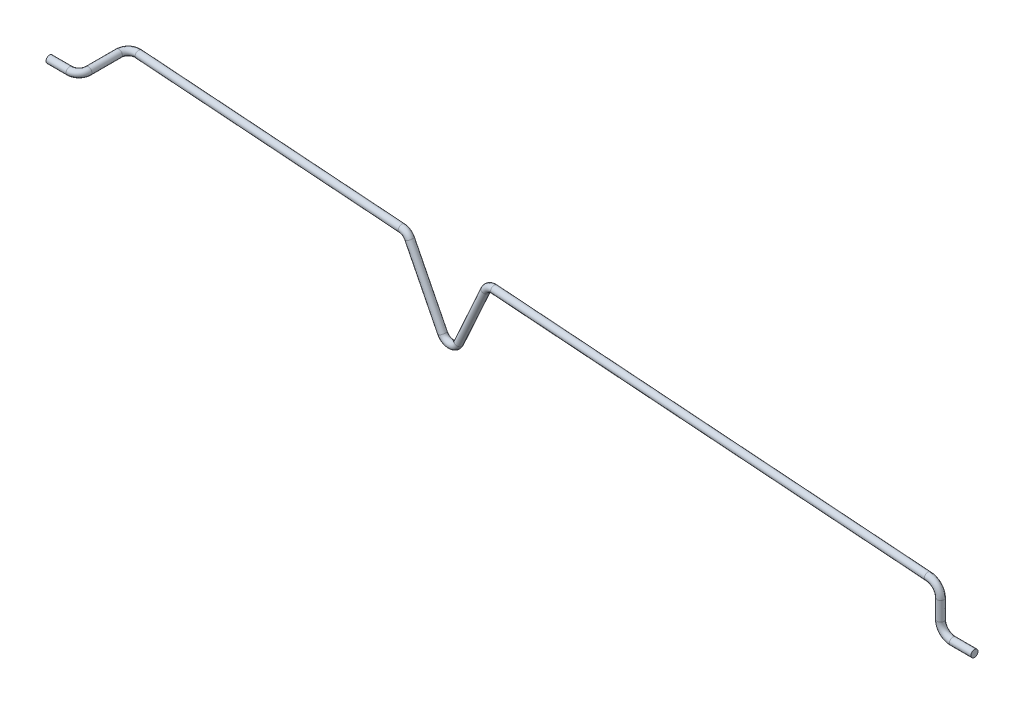
ISO-10303-21;
HEADER;
FILE_DESCRIPTION(('STEP AP214'),'2;1');
FILE_NAME('part.step','',(''),(''),'','','');
FILE_SCHEMA(('AUTOMOTIVE_DESIGN { 1 0 10303 214 1 1 1 1 }'));
ENDSEC;
DATA;
#1=APPLICATION_CONTEXT('core data for automotive mechanical design processes');
#2=APPLICATION_PROTOCOL_DEFINITION('international standard','automotive_design',2000,#1);
#3=PRODUCT_CONTEXT('',#1,'mechanical');
#4=PRODUCT('Part','Part','',(#3));
#5=PRODUCT_RELATED_PRODUCT_CATEGORY('part','',(#4));
#6=PRODUCT_DEFINITION_FORMATION('','',#4);
#7=PRODUCT_DEFINITION_CONTEXT('part definition',#1,'design');
#8=PRODUCT_DEFINITION('design','',#6,#7);
#9=PRODUCT_DEFINITION_SHAPE('','',#8);
#10=(LENGTH_UNIT() NAMED_UNIT(*) SI_UNIT(.MILLI.,.METRE.));
#11=(NAMED_UNIT(*) PLANE_ANGLE_UNIT() SI_UNIT($,.RADIAN.));
#12=(NAMED_UNIT(*) SI_UNIT($,.STERADIAN.) SOLID_ANGLE_UNIT());
#13=UNCERTAINTY_MEASURE_WITH_UNIT(LENGTH_MEASURE(1.E-05),#10,'distance_accuracy_value','');
#14=(GEOMETRIC_REPRESENTATION_CONTEXT(3) GLOBAL_UNCERTAINTY_ASSIGNED_CONTEXT((#13)) GLOBAL_UNIT_ASSIGNED_CONTEXT((#10,
#11,#12)) REPRESENTATION_CONTEXT('',''));
#15=CARTESIAN_POINT('',(0.,0.,0.));
#16=DIRECTION('',(0.,0.,1.));
#17=DIRECTION('',(1.,0.,0.));
#18=AXIS2_PLACEMENT_3D('',#15,#16,#17);
#19=CARTESIAN_POINT('',(-64.2188495074616,22.8960481279428,15.8483363673903));
#20=DIRECTION('',(1.,0.,0.));
#21=DIRECTION('',(0.,0.,-1.));
#22=AXIS2_PLACEMENT_3D('',#19,#20,#21);
#23=PLANE('',#22);
#24=CARTESIAN_POINT('',(-64.2188495074616,22.8960481279428,15.8483363673903));
#25=DIRECTION('',(1.,0.,0.));
#26=DIRECTION('',(0.,0.,-1.));
#27=AXIS2_PLACEMENT_3D('',#24,#25,#26);
#28=CIRCLE('',#27,0.375000000000001);
#29=CARTESIAN_POINT('',(-64.2188495074616,22.8960481279428,15.4733363673903));
#30=VERTEX_POINT('',#29);
#31=EDGE_CURVE('E235',#30,#30,#28,.T.);
#32=ORIENTED_EDGE('',*,*,#31,.F.);
#33=EDGE_LOOP('',(#32));
#34=FACE_BOUND('',#33,.T.);
#35=ADVANCED_FACE('F32',(#34),#23,.F.);
#36=CARTESIAN_POINT('',(31.4149506491111,14.4905385881416,13.));
#37=DIRECTION('',(1.,0.,0.));
#38=DIRECTION('',(0.,0.00337516126734805,-0.999994304126988));
#39=AXIS2_PLACEMENT_3D('',#36,#37,#38);
#40=PLANE('',#39);
#41=CARTESIAN_POINT('',(31.4149506491111,14.4905385881416,13.));
#42=DIRECTION('',(1.,0.,0.));
#43=DIRECTION('',(0.,0.00337516126734805,-0.999994304126988));
#44=AXIS2_PLACEMENT_3D('',#41,#42,#43);
#45=CIRCLE('',#44,0.375000000000001);
#46=CARTESIAN_POINT('',(31.4149506491111,14.4918042736168,12.6250021359524));
#47=VERTEX_POINT('',#46);
#48=EDGE_CURVE('E10',#47,#47,#45,.T.);
#49=ORIENTED_EDGE('',*,*,#48,.T.);
#50=EDGE_LOOP('',(#49));
#51=FACE_BOUND('',#50,.T.);
#52=ADVANCED_FACE('F129',(#51),#40,.T.);
#53=CARTESIAN_POINT('',(-59.66685028374,22.8959019788377,10.285494709423));
#54=CARTESIAN_POINT('',(-59.7419632939482,22.8959081179173,10.2735671038188));
#55=CARTESIAN_POINT('',(-59.7861856713361,22.8959117322668,10.2665215878197));
#56=CARTESIAN_POINT('',(-59.9491788533054,22.895925053902,10.2406873776312));
#57=CARTESIAN_POINT('',(-60.0620729197661,22.8959342808739,10.2336669901577));
#58=CARTESIAN_POINT('',(-60.2598447638031,22.895950445012,10.2453293695001));
#59=CARTESIAN_POINT('',(-60.3580820421677,22.8959584740666,10.2618879061166));
#60=CARTESIAN_POINT('',(-60.6439786449227,22.8959818407504,10.3425501113274));
#61=CARTESIAN_POINT('',(-60.8221902372007,22.8959964062049,10.4377969517152));
#62=CARTESIAN_POINT('',(-61.2740156605615,22.8960333344571,10.8235356976156));
#63=CARTESIAN_POINT('',(-61.45501726574,22.8960481279428,11.2145956624061));
#64=CARTESIAN_POINT('',(-61.45501726574,22.8960481279428,11.6121137336988));
#65=CARTESIAN_POINT('',(-59.6668317190504,23.0922515181698,10.2854788601156));
#66=CARTESIAN_POINT('',(-59.7419451260393,23.0922576572818,10.2735511915044));
#67=CARTESIAN_POINT('',(-59.7861665783051,23.0922612715557,10.2665058221397));
#68=CARTESIAN_POINT('',(-59.9491608616475,23.0922745932809,10.2406714376226));
#69=CARTESIAN_POINT('',(-60.0620566624428,23.0922838203945,10.2336509020387));
#70=CARTESIAN_POINT('',(-60.2598308147132,23.0922999847213,10.245313417495));
#71=CARTESIAN_POINT('',(-60.3580692396241,23.0923080138696,10.2618721473694));
#72=CARTESIAN_POINT('',(-60.643969179134,23.0923313808262,10.3425352940042));
#73=CARTESIAN_POINT('',(-60.822182851354,23.0923459464508,10.4377832460359));
#74=CARTESIAN_POINT('',(-61.2740135480564,23.0923828751335,10.8235264939696));
#75=CARTESIAN_POINT('',(-61.45501726574,23.0923976687921,11.2145910228949));
#76=CARTESIAN_POINT('',(-61.45501726574,23.0923976687921,11.6121137336988));
#77=CARTESIAN_POINT('',(-59.6948326599645,23.2709188671956,10.4619041950578));
#78=CARTESIAN_POINT('',(-59.765529332498,23.2709246453224,10.4506778838612));
#79=CARTESIAN_POINT('',(-59.8200487142283,23.270929101259,10.4420002644178));
#80=CARTESIAN_POINT('',(-59.9707831417774,23.2709414209707,10.4181064055597));
#81=CARTESIAN_POINT('',(-60.0643733360512,23.2709490702133,10.4127345499684));
#82=CARTESIAN_POINT('',(-60.2364535661927,23.270963134544,10.4228819242368));
#83=CARTESIAN_POINT('',(-60.3219292998683,23.2709701205817,10.4372894189219));
#84=CARTESIAN_POINT('',(-60.5706864140982,23.2709904518091,10.5074731748749));
#85=CARTESIAN_POINT('',(-60.7257473731661,23.2710031251335,10.5903469443642));
#86=CARTESIAN_POINT('',(-61.1188782721293,23.2710352562097,10.9259761765848));
#87=CARTESIAN_POINT('',(-61.2763668065893,23.2710481279428,11.2662353730734));
#88=CARTESIAN_POINT('',(-61.2763668065893,23.2710481279428,11.6121137336988));
#89=CARTESIAN_POINT('',(-59.756419834252,23.2709559965747,10.8497438363423));
#90=CARTESIAN_POINT('',(-59.817407103612,23.2709609811399,10.8400593343661));
#91=CARTESIAN_POINT('',(-59.8945646470963,23.2709672873216,10.8277935041633));
#92=CARTESIAN_POINT('',(-60.0183479676792,23.2709774042859,10.8081655449608));
#93=CARTESIAN_POINT('',(-60.0694982283107,23.2709815848601,10.8064180183642));
#94=CARTESIAN_POINT('',(-60.1850949520155,23.2709910327237,10.8132346248894));
#95=CARTESIAN_POINT('',(-60.2425141846665,23.2709957256688,10.8229130125867));
#96=CARTESIAN_POINT('',(-60.4096194202858,23.2710093833869,10.8700596966589));
#97=CARTESIAN_POINT('',(-60.5137832677416,23.2710178968272,10.92573103221));
#98=CARTESIAN_POINT('',(-60.7778731278621,23.2710394812195,11.1511935364873));
#99=CARTESIAN_POINT('',(-60.8836677248906,23.2710481279428,11.379766268474));
#100=CARTESIAN_POINT('',(-60.8836677248906,23.2710481279428,11.6121137336988));
#101=CARTESIAN_POINT('',(-59.7844545576776,23.0923224300603,11.0261980125646));
#102=CARTESIAN_POINT('',(-59.8410243705521,23.0923270535814,11.017214982658));
#103=CARTESIAN_POINT('',(-59.9284815269653,23.0923342015631,11.0033166355428));
#104=CARTESIAN_POINT('',(-60.0400029875627,23.0923433163506,10.9856295192288));
#105=CARTESIAN_POINT('',(-60.0718444856738,23.0923459187954,10.9855309421438));
#106=CARTESIAN_POINT('',(-60.1617430869135,23.0923532663199,10.9908321597924));
#107=CARTESIAN_POINT('',(-60.2063975419373,23.0923569159838,10.9983589606251));
#108=CARTESIAN_POINT('',(-60.3363538803235,23.0923675374764,11.0350245408887));
#109=CARTESIAN_POINT('',(-60.4173612297189,23.0923741583076,11.0783196710169));
#110=CARTESIAN_POINT('',(-60.6227416960955,23.0923909443078,11.2536599671513));
#111=CARTESIAN_POINT('',(-60.70501726574,23.0923976687921,11.4314190612556));
#112=CARTESIAN_POINT('',(-60.70501726574,23.0923976687921,11.6121137336988));
#113=CARTESIAN_POINT('',(-59.7844916870567,22.6996233513963,11.0262297111795));
#114=CARTESIAN_POINT('',(-59.8410607063701,22.6996279748524,11.0172468072868));
#115=CARTESIAN_POINT('',(-59.9285197130273,22.6996351229853,11.0033481669027));
#116=CARTESIAN_POINT('',(-60.0400389708783,22.6996442375928,10.985661399246));
#117=CARTESIAN_POINT('',(-60.0718770003203,22.6996468397542,10.985563118382));
#118=CARTESIAN_POINT('',(-60.1617709850934,22.6996541869013,10.9908640638026));
#119=CARTESIAN_POINT('',(-60.2064231470246,22.6996578363779,10.9983904781197));
#120=CARTESIAN_POINT('',(-60.336372811901,22.6996684573247,11.0350541755346));
#121=CARTESIAN_POINT('',(-60.4173760014123,22.6996750778159,11.0783470823748));
#122=CARTESIAN_POINT('',(-60.6227459211057,22.6996918629549,11.2536783744445));
#123=CARTESIAN_POINT('',(-60.70501726574,22.6996985870934,11.4314283402772));
#124=CARTESIAN_POINT('',(-60.70501726574,22.6996985870934,11.6121137336988));
#125=CARTESIAN_POINT('',(-59.7564907461426,22.5209560023704,10.8498043762373));
#126=CARTESIAN_POINT('',(-59.8174764999117,22.5209609868118,10.84012011493));
#127=CARTESIAN_POINT('',(-59.8946375771036,22.5209672932821,10.8278537246248));
#128=CARTESIAN_POINT('',(-60.018416690749,22.5209774099029,10.8082264313087));
#129=CARTESIAN_POINT('',(-60.0695603267119,22.5209815899356,10.8064794704524));
#130=CARTESIAN_POINT('',(-60.1851482336138,22.5209910370784,10.8132955570607));
#131=CARTESIAN_POINT('',(-60.2425630867806,22.5209957296658,10.822973206567));
#132=CARTESIAN_POINT('',(-60.4096555769362,22.5210093863418,10.8701162946643));
#133=CARTESIAN_POINT('',(-60.5138114795997,22.5210178991331,10.925783384047));
#134=CARTESIAN_POINT('',(-60.7778811970338,22.5210394818787,11.1512286918282));
#135=CARTESIAN_POINT('',(-60.8836677248906,22.5210481279428,11.3797839900994));
#136=CARTESIAN_POINT('',(-60.8836677248906,22.5210481279428,11.6121137336988));
#137=CARTESIAN_POINT('',(-59.6949035718551,22.5209188729913,10.4619647349527));
#138=CARTESIAN_POINT('',(-59.7655987287977,22.5209246509943,10.4507386644251));
#139=CARTESIAN_POINT('',(-59.8201216442356,22.5209291072195,10.4420604848793));
#140=CARTESIAN_POINT('',(-59.9708518648472,22.5209414265877,10.4181672919076));
#141=CARTESIAN_POINT('',(-60.0644354344523,22.5209490752888,10.4127960020566));
#142=CARTESIAN_POINT('',(-60.2365068477911,22.5209631388987,10.4229428564081));
#143=CARTESIAN_POINT('',(-60.3219782019824,22.5209701245786,10.4373496129025));
#144=CARTESIAN_POINT('',(-60.5707225707487,22.520990454764,10.5075297728799));
#145=CARTESIAN_POINT('',(-60.7257755850231,22.5210031274395,10.5903992962007));
#146=CARTESIAN_POINT('',(-61.118886341303,22.5210352568689,10.9260113319267));
#147=CARTESIAN_POINT('',(-61.2763668065893,22.5210481279428,11.2662530946981));
#148=CARTESIAN_POINT('',(-61.2763668065893,22.5210481279428,11.6121137336988));
#149=CARTESIAN_POINT('',(-59.6668688484295,22.6995524395057,10.2855105587304));
#150=CARTESIAN_POINT('',(-59.7419814618572,22.6995585785528,10.2735830161332));
#151=CARTESIAN_POINT('',(-59.7862047643672,22.6995621929779,10.2665373534997));
#152=CARTESIAN_POINT('',(-59.9491968449632,22.6995755145231,10.2407033176398));
#153=CARTESIAN_POINT('',(-60.0620891770893,22.6995847413533,10.2336830782768));
#154=CARTESIAN_POINT('',(-60.2598587128931,22.6996009053027,10.2453453215053));
#155=CARTESIAN_POINT('',(-60.3580948447114,22.6996089342637,10.2619036648638));
#156=CARTESIAN_POINT('',(-60.6439881107115,22.6996323006746,10.3425649286506));
#157=CARTESIAN_POINT('',(-60.8221976230474,22.6996468659591,10.4378106573944));
#158=CARTESIAN_POINT('',(-61.2740177730667,22.6996837937806,10.8235449012617));
#159=CARTESIAN_POINT('',(-61.45501726574,22.6996985870934,11.2146003019172));
#160=CARTESIAN_POINT('',(-61.45501726574,22.6996985870934,11.6121137336988));
#161=CARTESIAN_POINT('',(-59.66685028374,22.8959019788377,10.285494709423));
#162=CARTESIAN_POINT('',(-59.7419632939482,22.8959081179173,10.2735671038188));
#163=CARTESIAN_POINT('',(-59.7861856713361,22.8959117322668,10.2665215878197));
#164=CARTESIAN_POINT('',(-59.9491788533054,22.895925053902,10.2406873776312));
#165=CARTESIAN_POINT('',(-60.0620729197661,22.8959342808739,10.2336669901577));
#166=CARTESIAN_POINT('',(-60.2598447638031,22.895950445012,10.2453293695001));
#167=CARTESIAN_POINT('',(-60.3580820421677,22.8959584740666,10.2618879061166));
#168=CARTESIAN_POINT('',(-60.6439786449227,22.8959818407504,10.3425501113274));
#169=CARTESIAN_POINT('',(-60.8221902372007,22.8959964062049,10.4377969517152));
#170=CARTESIAN_POINT('',(-61.2740156605615,22.8960333344571,10.8235356976156));
#171=CARTESIAN_POINT('',(-61.45501726574,22.8960481279428,11.2145956624061));
#172=CARTESIAN_POINT('',(-61.45501726574,22.8960481279428,11.6121137336988));
#173=B_SPLINE_SURFACE_WITH_KNOTS('',3,3,((#53,#54,#55,#56,#57,#58,#59,#60,#61,#62,#63,#64),(#65,
#66,#67,#68,#69,#70,#71,#72,#73,#74,#75,#76),(#77,#78,#79,#80,#81,#82,#83,#84,#85,#86,#87,#88),
(#89,#90,#91,#92,#93,#94,#95,#96,#97,#98,#99,#100),(#101,#102,#103,#104,#105,#106,#107,#108,
#109,#110,#111,#112),(#113,#114,#115,#116,#117,#118,#119,#120,#121,#122,#123,#124),(#125,#126,
#127,#128,#129,#130,#131,#132,#133,#134,#135,#136),(#137,#138,#139,#140,#141,#142,#143,#144,
#145,#146,#147,#148),(#149,#150,#151,#152,#153,#154,#155,#156,#157,#158,#159,#160),(#161,#162,
#163,#164,#165,#166,#167,#168,#169,#170,#171,#172)),.UNSPECIFIED.,.T.,.F.,.F.,(4,2,2,2,4),(4,2,
2,2,2,4),(0.,0.25,0.5,0.75,1.),(-0.0229632619529378,0.,0.0249056285781138,0.0498112571562277,
0.0996225143124553,0.199245028624911),.UNSPECIFIED.);
#174=CARTESIAN_POINT('',(-59.9231868103733,22.895953578755,10.6244881938014));
#175=DIRECTION('',(-0.995488107498007,0.0217371518266946,-0.0923630015780107));
#176=DIRECTION('',(-0.0808192973258083,0.315774535423993,0.945385997335228));
#177=AXIS2_PLACEMENT_3D('',#174,#175,#176);
#178=ELLIPSE('',#177,0.375880853129422,0.375000000000001);
#179=CARTESIAN_POINT('',(-59.9535652368014,23.0146471805267,10.9798406890164));
#180=VERTEX_POINT('',#179);
#181=EDGE_CURVE('E35',#180,#180,#178,.T.);
#182=CARTESIAN_POINT('',(-61.08001726574,22.8960481279428,11.6121137336988));
#183=DIRECTION('',(0.,0.,-1.));
#184=DIRECTION('',(-1.,0.,0.));
#185=AXIS2_PLACEMENT_3D('',#182,#183,#184);
#186=CIRCLE('',#185,0.375000000000001);
#187=CARTESIAN_POINT('',(-61.45501726574,22.8960481279428,11.6121137336988));
#188=VERTEX_POINT('',#187);
#189=EDGE_CURVE('E226',#188,#188,#186,.T.);
#190=ORIENTED_EDGE('',*,*,#181,.T.);
#191=EDGE_LOOP('',(#190));
#192=FACE_BOUND('',#191,.T.);
#193=ORIENTED_EDGE('',*,*,#189,.T.);
#194=EDGE_LOOP('',(#193));
#195=FACE_BOUND('',#194,.T.);
#196=ADVANCED_FACE('F122',(#192,#195),#173,.F.);
#197=CARTESIAN_POINT('',(-61.08001726574,22.8960481279428,11.6121137336988));
#198=DIRECTION('',(0.,0.,1.));
#199=DIRECTION('',(1.,0.,0.));
#200=AXIS2_PLACEMENT_3D('',#197,#198,#199);
#201=CYLINDRICAL_SURFACE('',#200,0.375000000000001);
#202=CARTESIAN_POINT('',(-61.08001726574,22.8960481279428,14.8483363673903));
#203=DIRECTION('',(0.,0.,-1.));
#204=DIRECTION('',(-1.,0.,0.));
#205=AXIS2_PLACEMENT_3D('',#202,#203,#204);
#206=CIRCLE('',#205,0.375000000000001);
#207=CARTESIAN_POINT('',(-60.70501726574,22.8960481279428,14.8483363673903));
#208=VERTEX_POINT('',#207);
#209=EDGE_CURVE('E228',#208,#208,#206,.T.);
#210=ORIENTED_EDGE('',*,*,#209,.T.);
#211=EDGE_LOOP('',(#210));
#212=FACE_BOUND('',#211,.T.);
#213=ORIENTED_EDGE('',*,*,#189,.F.);
#214=EDGE_LOOP('',(#213));
#215=FACE_BOUND('',#214,.T.);
#216=ADVANCED_FACE('F111',(#212,#215),#201,.T.);
#217=CARTESIAN_POINT('',(-62.08001726574,22.8960481279428,14.8483363673903));
#218=DIRECTION('',(0.,-1.,0.));
#219=DIRECTION('',(0.,0.,-1.));
#220=AXIS2_PLACEMENT_3D('',#217,#218,#219);
#221=TOROIDAL_SURFACE('',#220,1.00000000000001,0.375000000000001);
#222=CARTESIAN_POINT('',(-62.08001726574,22.8960481279428,15.8483363673903));
#223=DIRECTION('',(1.,0.,0.));
#224=DIRECTION('',(0.,0.,-1.));
#225=AXIS2_PLACEMENT_3D('',#222,#223,#224);
#226=CIRCLE('',#225,0.375000000000001);
#227=CARTESIAN_POINT('',(-62.08001726574,22.8960481279428,16.2233363673903));
#228=VERTEX_POINT('',#227);
#229=EDGE_CURVE('E232',#228,#228,#226,.T.);
#230=CARTESIAN_POINT('',(-62.08001726574,22.8960481279428,14.8483363673903));
#231=DIRECTION('',(0.,-1.,0.));
#232=DIRECTION('',(0.,0.,-1.));
#233=AXIS2_PLACEMENT_3D('',#230,#231,#232);
#234=CIRCLE('',#233,1.37500000000001);
#235=EDGE_CURVE('',#208,#228,#234,.T.);
#236=ORIENTED_EDGE('',*,*,#209,.F.);
#237=ORIENTED_EDGE('',*,*,#229,.T.);
#238=ORIENTED_EDGE('',*,*,#235,.T.);
#239=ORIENTED_EDGE('',*,*,#235,.F.);
#240=EDGE_LOOP('',(#236,#238,#237,#239));
#241=FACE_BOUND('',#240,.T.);
#242=ADVANCED_FACE('F121',(#241),#221,.T.);
#243=CARTESIAN_POINT('',(-62.08001726574,22.8960481279428,15.8483363673903));
#244=DIRECTION('',(-1.,0.,0.));
#245=DIRECTION('',(0.,0.,1.));
#246=AXIS2_PLACEMENT_3D('',#243,#244,#245);
#247=CYLINDRICAL_SURFACE('',#246,0.375000000000001);
#248=ORIENTED_EDGE('',*,*,#31,.T.);
#249=EDGE_LOOP('',(#248));
#250=FACE_BOUND('',#249,.T.);
#251=ORIENTED_EDGE('',*,*,#229,.F.);
#252=EDGE_LOOP('',(#251));
#253=FACE_BOUND('',#252,.T.);
#254=ADVANCED_FACE('F90',(#250,#253),#247,.T.);
#255=CARTESIAN_POINT('',(26.6556677747406,19.1428719036104,13.0053038780196));
#256=DIRECTION('',(-0.998684950906861,0.0432917044981977,-0.027462650159852));
#257=DIRECTION('',(-0.0433080389785005,-0.999061766739092,0.));
#258=AXIS2_PLACEMENT_3D('',#255,#256,#257);
#259=CYLINDRICAL_SURFACE('',#258,0.375000000000001);
#260=CARTESIAN_POINT('',(26.4611326516824,19.152765244194,12.624814038488));
#261=CARTESIAN_POINT('',(26.4607691836794,19.1330148023952,12.6247497812131));
#262=CARTESIAN_POINT('',(26.4603805356909,19.1132608442629,12.626504011793));
#263=CARTESIAN_POINT('',(26.4595669916344,19.0743274861774,12.6334045187162));
#264=CARTESIAN_POINT('',(26.4591420184419,19.0551494316947,12.6385581765406));
#265=CARTESIAN_POINT('',(26.4582728467392,19.0179883676209,12.6518537983054));
#266=CARTESIAN_POINT('',(26.4578287703566,18.9999992207451,12.6599787216062));
#267=CARTESIAN_POINT('',(26.4569317301739,18.9654742875904,12.6788133911895));
#268=CARTESIAN_POINT('',(26.4564787681213,18.9489382189655,12.689522633794));
#269=CARTESIAN_POINT('',(26.4550211473983,18.8984775829741,12.7276607176761));
#270=CARTESIAN_POINT('',(26.4540129111647,18.8677563683137,12.759627459868));
#271=CARTESIAN_POINT('',(26.4525526837515,18.8297274947308,12.8145599529353));
#272=CARTESIAN_POINT('',(26.4520607410307,18.8181847013693,12.8347613782733));
#273=CARTESIAN_POINT('',(26.4511234819598,18.7989687173499,12.8769569987221));
#274=CARTESIAN_POINT('',(26.4506781111512,18.7912909661073,12.8989490451943));
#275=CARTESIAN_POINT('',(26.4498881313585,18.7808752574254,12.9422356731663));
#276=CARTESIAN_POINT('',(26.449538325614,18.7777929811835,12.9634466096379));
#277=CARTESIAN_POINT('',(26.4489140791441,18.7758528664935,13.0060543679817));
#278=CARTESIAN_POINT('',(26.4486395715797,18.7769912683964,13.0274510074906));
#279=CARTESIAN_POINT('',(26.4482023496195,18.7829000745747,13.0670012085214));
#280=CARTESIAN_POINT('',(26.4480299887026,18.7872021587518,13.0852276807053));
#281=CARTESIAN_POINT('',(26.4477483760824,18.7985589457747,13.1207879300875));
#282=CARTESIAN_POINT('',(26.447639166309,18.805615472264,13.1381211072343));
#283=CARTESIAN_POINT('',(26.4473921432408,18.8317714290636,13.1909447840266));
#284=CARTESIAN_POINT('',(26.4473664933114,18.8553760986522,13.2243318233828));
#285=CARTESIAN_POINT('',(26.447536000939,18.8987087775704,13.2699398603377));
#286=CARTESIAN_POINT('',(26.4476393770768,18.9156073217927,13.2850269484565));
#287=CARTESIAN_POINT('',(26.4479294332928,18.9517050121617,13.3122424288723));
#288=CARTESIAN_POINT('',(26.448116179385,18.9709059725787,13.3243684647544));
#289=CARTESIAN_POINT('',(26.4485748750963,19.0113638979059,13.3451975791983));
#290=CARTESIAN_POINT('',(26.4488477564891,19.0326414999516,13.3538607576084));
#291=CARTESIAN_POINT('',(26.449475087118,19.0764536854633,13.3669601114042));
#292=CARTESIAN_POINT('',(26.4498293993908,19.0989861106861,13.3714033209125));
#293=CARTESIAN_POINT('',(26.450565297101,19.1417770024293,13.3752775664378));
#294=CARTESIAN_POINT('',(26.4509386353234,19.1619874228505,13.3752415738531));
#295=CARTESIAN_POINT('',(26.4517297959981,19.2020621904103,13.371486392923));
#296=CARTESIAN_POINT('',(26.4521476374202,19.2219263857375,13.367765628278));
#297=CARTESIAN_POINT('',(26.4529821048118,19.2593920525525,13.3573896823117));
#298=CARTESIAN_POINT('',(26.4533968473082,19.2770552625955,13.3509533429433));
#299=CARTESIAN_POINT('',(26.4542396970355,19.3112184163353,13.3355591481779));
#300=CARTESIAN_POINT('',(26.4546678066151,19.327718153914,13.3266008473922));
#301=CARTESIAN_POINT('',(26.4560705114827,19.3791745961469,13.2937691504496));
#302=CARTESIAN_POINT('',(26.4570578988224,19.4113610313541,13.2652691570633));
#303=CARTESIAN_POINT('',(26.4585245991298,19.4531936346731,13.2149488012459));
#304=CARTESIAN_POINT('',(26.4590314556965,19.4664457119685,13.1959506904479));
#305=CARTESIAN_POINT('',(26.4600089618796,19.4894415853906,13.155889902934));
#306=CARTESIAN_POINT('',(26.4604796196366,19.4991861721116,13.1348276928331));
#307=CARTESIAN_POINT('',(26.4613456144605,19.5141920879575,13.0921684601659));
#308=CARTESIAN_POINT('',(26.4617433211896,19.5196282964833,13.0706334539364));
#309=CARTESIAN_POINT('',(26.4624673267403,19.5261532638337,13.026926724413));
#310=CARTESIAN_POINT('',(26.4627937524446,19.5272498079973,13.0047562132776));
#311=CARTESIAN_POINT('',(26.4633210683673,19.5250885346828,12.9636884086415));
#312=CARTESIAN_POINT('',(26.4635330271129,19.5224063301488,12.9447585584884));
#313=CARTESIAN_POINT('',(26.4638912866307,19.513991110222,12.9075777901196));
#314=CARTESIAN_POINT('',(26.4640374525191,19.5082518796142,12.8893283363809));
#315=CARTESIAN_POINT('',(26.4643817922188,19.4866397559041,12.8355277449585));
#316=CARTESIAN_POINT('',(26.4644771831989,19.4664267698536,12.8016214530489));
#317=CARTESIAN_POINT('',(26.4644269568177,19.4281485176355,12.754128152221));
#318=CARTESIAN_POINT('',(26.464367635101,19.4129259545166,12.7380899388836));
#319=CARTESIAN_POINT('',(26.4641691261612,19.380085485446,12.7085966947131));
#320=CARTESIAN_POINT('',(26.4640298469623,19.3624648387945,12.695144662619));
#321=CARTESIAN_POINT('',(26.4636633480013,19.3243366640788,12.6707518938343));
#322=CARTESIAN_POINT('',(26.4634321931799,19.3037306090286,12.6599644725216));
#323=CARTESIAN_POINT('',(26.4628847551225,19.2609172882656,12.6424146374638));
#324=CARTESIAN_POINT('',(26.4625687274964,19.2387149746478,12.635640330743));
#325=CARTESIAN_POINT('',(26.4618848802988,19.1952170600356,12.6270529076298));
#326=CARTESIAN_POINT('',(26.4615233101126,19.1739931831717,12.6248831027411));
#327=CARTESIAN_POINT('',(26.4611326516824,19.152765244194,12.624814038488));
#328=B_SPLINE_CURVE_WITH_KNOTS('',3,(#260,#261,#262,#263,#264,#265,#266,#267,#268,#269,#270,
#271,#272,#273,#274,#275,#276,#277,#278,#279,#280,#281,#282,#283,#284,#285,#286,#287,#288,#289,
#290,#291,#292,#293,#294,#295,#296,#297,#298,#299,#300,#301,#302,#303,#304,#305,#306,#307,#308,
#309,#310,#311,#312,#313,#314,#315,#316,#317,#318,#319,#320,#321,#322,#323,#324,#325,#326,#327),
.UNSPECIFIED.,.T.,.F.,(4,2,2,2,2,2,2,2,2,2,2,2,2,2,2,2,2,2,2,2,2,2,2,2,2,2,2,2,2,2,2,2,2,4),(0.,
0.05918459036512,0.118498118465079,0.177476677140948,0.236443750301533,0.36684682644776,
0.436375472166972,0.50582188361996,0.569744868280976,0.633610926019884,0.68955028758337,
0.745526748110397,0.866033728001825,0.933765622540419,1.00155124394909,1.07009683377417,
1.13852796572137,1.19882542892012,1.25914869777079,1.315333244057,1.37152771899149,
1.49811450420513,1.56735966269204,1.63658920341442,1.70283965041427,1.7689711903798,
1.82604847692585,1.88324225226625,1.99963945470717,2.06576606492012,2.13196889408505,
2.20138039184734,2.27058514411813,2.33419723368511),.UNSPECIFIED.);
#329=CARTESIAN_POINT('',(26.461132651683,19.152765244194,12.624814038488));
#330=VERTEX_POINT('',#329);
#331=EDGE_CURVE('E67',#330,#330,#328,.T.);
#332=ORIENTED_EDGE('',*,*,#331,.T.);
#333=EDGE_LOOP('',(#332));
#334=FACE_BOUND('',#333,.T.);
#335=CARTESIAN_POINT('',(-21.026499778463,21.2098323656384,11.6941008953492));
#336=DIRECTION('',(0.998684950906861,-0.0432917044981977,0.027462650159852));
#337=DIRECTION('',(0.0276064476766096,0.00272714377870501,-0.999615149311718));
#338=AXIS2_PLACEMENT_3D('',#335,#336,#337);
#339=CIRCLE('',#338,0.375000000000001);
#340=CARTESIAN_POINT('',(-21.0104190881783,21.5844432454198,11.6998541682792));
#341=VERTEX_POINT('',#340);
#342=EDGE_CURVE('E49',#341,#341,#339,.T.);
#343=ORIENTED_EDGE('',*,*,#342,.T.);
#344=EDGE_LOOP('',(#343));
#345=FACE_BOUND('',#344,.T.);
#346=ADVANCED_FACE('F85',(#334,#345),#259,.T.);
#347=CARTESIAN_POINT('',(-21.0693816192223,20.2108700195548,11.6787588342026));
#348=DIRECTION('',(-0.0280983374109124,-0.014144236592073,0.999505089534801));
#349=DIRECTION('',(0.999605084747423,0.,0.0281011485013743));
#350=AXIS2_PLACEMENT_3D('',#347,#348,#349);
#351=TOROIDAL_SURFACE('',#350,1.,0.375000000000001);
#352=CARTESIAN_POINT('',(-21.9748546219661,20.6348277183897,11.6593034775928));
#353=DIRECTION('',(0.423472696566027,0.905571537853241,0.0247197308483585));
#354=DIRECTION('',(0.0384442729111264,0.00929831270203577,-0.999217483464551));
#355=AXIS2_PLACEMENT_3D('',#352,#353,#354);
#356=CIRCLE('',#355,0.375000000000001);
#357=CARTESIAN_POINT('',(-22.314406997995,20.7938118554527,11.6520077188641));
#358=VERTEX_POINT('',#357);
#359=EDGE_CURVE('E52',#358,#358,#356,.T.);
#360=CARTESIAN_POINT('',(-21.0693816192223,20.2108700195548,11.6787588342026));
#361=DIRECTION('',(-0.0280983374109124,-0.014144236592073,0.999505089534801));
#362=DIRECTION('',(0.999605084747423,0.,0.0281011485013743));
#363=AXIS2_PLACEMENT_3D('',#360,#361,#362);
#364=CIRCLE('',#363,1.375);
#365=EDGE_CURVE('',#341,#358,#364,.T.);
#366=ORIENTED_EDGE('',*,*,#342,.F.);
#367=ORIENTED_EDGE('',*,*,#359,.T.);
#368=ORIENTED_EDGE('',*,*,#365,.T.);
#369=ORIENTED_EDGE('',*,*,#365,.F.);
#370=EDGE_LOOP('',(#366,#368,#367,#369));
#371=FACE_BOUND('',#370,.T.);
#372=ADVANCED_FACE('F89',(#371),#351,.T.);
#373=CARTESIAN_POINT('',(-21.9748546219661,20.6348277183897,11.6593034775928));
#374=DIRECTION('',(-0.423472696566024,-0.905571537853241,-0.0247197308483568));
#375=DIRECTION('',(0.905848346298783,-0.423602140584488,0.));
#376=AXIS2_PLACEMENT_3D('',#373,#374,#375);
#377=CYLINDRICAL_SURFACE('',#376,0.375000000000001);
#378=CARTESIAN_POINT('',(-24.9942013941655,14.178131638607,11.4830525878616));
#379=DIRECTION('',(0.423472696566025,0.905571537853242,0.0247197308483568));
#380=DIRECTION('',(0.0384442729111257,0.0092983127020343,-0.999217483464551));
#381=AXIS2_PLACEMENT_3D('',#378,#379,#380);
#382=CIRCLE('',#381,0.375000000000001);
#383=CARTESIAN_POINT('',(-24.6546490181366,14.019147501544,11.4903483465903));
#384=VERTEX_POINT('',#383);
#385=EDGE_CURVE('E55',#384,#384,#382,.T.);
#386=ORIENTED_EDGE('',*,*,#385,.T.);
#387=EDGE_LOOP('',(#386));
#388=FACE_BOUND('',#387,.T.);
#389=ORIENTED_EDGE('',*,*,#359,.F.);
#390=EDGE_LOOP('',(#389));
#391=FACE_BOUND('',#390,.T.);
#392=ADVANCED_FACE('F195',(#388,#391),#377,.T.);
#393=CARTESIAN_POINT('',(-25.8996743969093,14.6020893374419,11.4635972312518));
#394=DIRECTION('',(0.0280983374109124,0.0141442365920712,-0.999505089534801));
#395=DIRECTION('',(-0.999605084747423,0.,-0.0281011485013743));
#396=AXIS2_PLACEMENT_3D('',#393,#394,#395);
#397=TOROIDAL_SURFACE('',#396,0.999999999999998,0.375000000000001);
#398=CARTESIAN_POINT('',(-26.7924474176492,14.1526822197359,11.4321397044254));
#399=DIRECTION('',(0.449629644122343,-0.893215082231831,-1.9541182720097E-13));
#400=DIRECTION('',(0.0178938678969091,0.00900747604322991,-0.999799317296736));
#401=AXIS2_PLACEMENT_3D('',#398,#399,#400);
#402=CIRCLE('',#401,0.375000000000001);
#403=CARTESIAN_POINT('',(-27.1272373004267,13.9841545505961,11.4203431318655));
#404=VERTEX_POINT('',#403);
#405=EDGE_CURVE('E58',#404,#404,#402,.T.);
#406=CARTESIAN_POINT('',(-25.8996743969093,14.6020893374419,11.4635972312518));
#407=DIRECTION('',(0.0280983374109124,0.0141442365920712,-0.999505089534801));
#408=DIRECTION('',(-0.999605084747423,0.,-0.0281011485013743));
#409=AXIS2_PLACEMENT_3D('',#406,#407,#408);
#410=CIRCLE('',#409,1.375);
#411=EDGE_CURVE('',#384,#404,#410,.T.);
#412=ORIENTED_EDGE('',*,*,#385,.F.);
#413=ORIENTED_EDGE('',*,*,#405,.T.);
#414=ORIENTED_EDGE('',*,*,#411,.T.);
#415=ORIENTED_EDGE('',*,*,#411,.F.);
#416=EDGE_LOOP('',(#412,#414,#413,#415));
#417=FACE_BOUND('',#416,.T.);
#418=ADVANCED_FACE('F200',(#417),#397,.T.);
#419=CARTESIAN_POINT('',(-26.7924474176492,14.1526822197359,11.4321397044254));
#420=DIRECTION('',(-0.449629644122344,0.893215082231829,1.94523058664612E-13));
#421=DIRECTION('',(-0.89321508223183,-0.449629644122344,0.));
#422=AXIS2_PLACEMENT_3D('',#419,#420,#421);
#423=CYLINDRICAL_SURFACE('',#422,0.375000000000001);
#424=CARTESIAN_POINT('',(-30.2889237075634,21.0986329541753,11.4321397044269));
#425=DIRECTION('',(0.449629644122344,-0.89321508223183,-1.94519302736331E-13));
#426=DIRECTION('',(0.0178938678969095,0.00900747604322914,-0.999799317296736));
#427=AXIS2_PLACEMENT_3D('',#424,#425,#426);
#428=CIRCLE('',#427,0.375000000000001);
#429=CARTESIAN_POINT('',(-29.9541338247859,21.2671606233151,11.4439362769868));
#430=VERTEX_POINT('',#429);
#431=EDGE_CURVE('E61',#430,#430,#428,.T.);
#432=ORIENTED_EDGE('',*,*,#431,.T.);
#433=EDGE_LOOP('',(#432));
#434=FACE_BOUND('',#433,.T.);
#435=ORIENTED_EDGE('',*,*,#405,.F.);
#436=EDGE_LOOP('',(#435));
#437=FACE_BOUND('',#436,.T.);
#438=ADVANCED_FACE('F207',(#434,#437),#423,.T.);
#439=CARTESIAN_POINT('',(-31.1816967283034,20.6492258364693,11.4006821776006));
#440=DIRECTION('',(-0.0280983374109124,-0.014144236592073,0.999505089534801));
#441=DIRECTION('',(0.999605084747424,0.,0.0281011485013742));
#442=AXIS2_PLACEMENT_3D('',#439,#440,#441);
#443=TOROIDAL_SURFACE('',#442,1.,0.375000000000001);
#444=CARTESIAN_POINT('',(-31.1388148875441,21.6481881825529,11.4160242387473));
#445=DIRECTION('',(0.99868495090686,-0.0432917044982054,0.0274626501598509));
#446=DIRECTION('',(0.0276064476766086,0.00272714377870502,-0.999615149311718));
#447=AXIS2_PLACEMENT_3D('',#444,#445,#446);
#448=CIRCLE('',#447,0.375000000000001);
#449=CARTESIAN_POINT('',(-31.1227341972593,22.0227990623343,11.4217775116772));
#450=VERTEX_POINT('',#449);
#451=EDGE_CURVE('E64',#450,#450,#448,.T.);
#452=CARTESIAN_POINT('',(-31.1816967283034,20.6492258364693,11.4006821776006));
#453=DIRECTION('',(-0.0280983374109124,-0.014144236592073,0.999505089534801));
#454=DIRECTION('',(0.999605084747424,0.,0.0281011485013742));
#455=AXIS2_PLACEMENT_3D('',#452,#453,#454);
#456=CIRCLE('',#455,1.375);
#457=EDGE_CURVE('',#430,#450,#456,.T.);
#458=ORIENTED_EDGE('',*,*,#431,.F.);
#459=ORIENTED_EDGE('',*,*,#451,.T.);
#460=ORIENTED_EDGE('',*,*,#457,.T.);
#461=ORIENTED_EDGE('',*,*,#457,.F.);
#462=EDGE_LOOP('',(#458,#460,#459,#461));
#463=FACE_BOUND('',#462,.T.);
#464=ADVANCED_FACE('F167',(#463),#443,.T.);
#465=CARTESIAN_POINT('',(-31.1388148875441,21.6481881825529,11.4160242387472));
#466=DIRECTION('',(-0.99868495090686,0.0432917044981976,-0.0274626501598519));
#467=DIRECTION('',(-0.0433080389785004,-0.999061766739092,0.));
#468=AXIS2_PLACEMENT_3D('',#465,#466,#467);
#469=CYLINDRICAL_SURFACE('',#468,0.375000000000001);
#470=ORIENTED_EDGE('',*,*,#451,.F.);
#471=EDGE_LOOP('',(#470));
#472=FACE_BOUND('',#471,.T.);
#473=ORIENTED_EDGE('',*,*,#181,.F.);
#474=EDGE_LOOP('',(#473));
#475=FACE_BOUND('',#474,.T.);
#476=ADVANCED_FACE('F157',(#472,#475),#469,.T.);
#477=CARTESIAN_POINT('',(31.4149506491111,14.4905385881416,13.));
#478=DIRECTION('',(-1.,0.,0.));
#479=DIRECTION('',(0.,0.,1.));
#480=AXIS2_PLACEMENT_3D('',#477,#478,#479);
#481=CYLINDRICAL_SURFACE('',#480,0.375000000000001);
#482=CARTESIAN_POINT('',(29.1254922740607,14.4905385881416,13.));
#483=DIRECTION('',(1.,0.,0.));
#484=DIRECTION('',(0.,0.00337516126734805,-0.999994304126988));
#485=AXIS2_PLACEMENT_3D('',#482,#483,#484);
#486=CIRCLE('',#485,0.375000000000001);
#487=CARTESIAN_POINT('',(29.1254922740607,14.1155385881416,13.));
#488=VERTEX_POINT('',#487);
#489=EDGE_CURVE('E40',#488,#488,#486,.T.);
#490=ORIENTED_EDGE('',*,*,#489,.T.);
#491=EDGE_LOOP('',(#490));
#492=FACE_BOUND('',#491,.T.);
#493=ORIENTED_EDGE('',*,*,#48,.F.);
#494=EDGE_LOOP('',(#493));
#495=FACE_BOUND('',#494,.T.);
#496=ADVANCED_FACE('F166',(#492,#495),#481,.T.);
#497=CARTESIAN_POINT('',(29.1254922740607,15.8210481279423,13.));
#498=DIRECTION('',(0.,0.,-1.));
#499=DIRECTION('',(-1.,0.,0.));
#500=AXIS2_PLACEMENT_3D('',#497,#498,#499);
#501=TOROIDAL_SURFACE('',#500,1.33050953980071,0.375000000000001);
#502=CARTESIAN_POINT('',(27.79498273426,15.8210481279423,13.));
#503=DIRECTION('',(0.,-1.,0.));
#504=DIRECTION('',(0.00337516126734805,0.,-0.999994304126988));
#505=AXIS2_PLACEMENT_3D('',#502,#503,#504);
#506=CIRCLE('',#505,0.375000000000001);
#507=CARTESIAN_POINT('',(27.41998273426,15.8210481279423,13.));
#508=VERTEX_POINT('',#507);
#509=EDGE_CURVE('E45',#508,#508,#506,.T.);
#510=CARTESIAN_POINT('',(29.1254922740607,15.8210481279423,13.));
#511=DIRECTION('',(0.,0.,-1.));
#512=DIRECTION('',(-1.,0.,0.));
#513=AXIS2_PLACEMENT_3D('',#510,#511,#512);
#514=CIRCLE('',#513,1.70550953980071);
#515=EDGE_CURVE('',#488,#508,#514,.T.);
#516=ORIENTED_EDGE('',*,*,#489,.F.);
#517=ORIENTED_EDGE('',*,*,#509,.T.);
#518=ORIENTED_EDGE('',*,*,#515,.T.);
#519=ORIENTED_EDGE('',*,*,#515,.F.);
#520=EDGE_LOOP('',(#516,#518,#517,#519));
#521=FACE_BOUND('',#520,.T.);
#522=ADVANCED_FACE('F184',(#521),#501,.T.);
#523=CARTESIAN_POINT('',(27.79498273426,15.8210481279423,13.));
#524=DIRECTION('',(0.,1.,0.));
#525=DIRECTION('',(0.,0.,1.));
#526=AXIS2_PLACEMENT_3D('',#523,#524,#525);
#527=CYLINDRICAL_SURFACE('',#526,0.375000000000001);
#528=CARTESIAN_POINT('',(27.79498273426,17.8210481279423,13.));
#529=DIRECTION('',(0.,-1.,0.));
#530=DIRECTION('',(0.00337516126734805,0.,-0.999994304126988));
#531=AXIS2_PLACEMENT_3D('',#528,#529,#530);
#532=CIRCLE('',#531,0.375000000000001);
#533=CARTESIAN_POINT('',(27.7962484197353,17.8210481279423,12.6250021359524));
#534=VERTEX_POINT('',#533);
#535=EDGE_CURVE('E104',#534,#534,#532,.T.);
#536=ORIENTED_EDGE('',*,*,#535,.T.);
#537=EDGE_LOOP('',(#536));
#538=FACE_BOUND('',#537,.T.);
#539=ORIENTED_EDGE('',*,*,#509,.F.);
#540=EDGE_LOOP('',(#539));
#541=FACE_BOUND('',#540,.T.);
#542=ADVANCED_FACE('F179',(#538,#541),#527,.T.);
#543=CARTESIAN_POINT('',(27.7962484197353,17.8210481279423,12.6250021359524));
#544=CARTESIAN_POINT('',(27.7962484197353,18.1720170342714,12.6250021359524));
#545=CARTESIAN_POINT('',(27.6514960448435,18.5189975589164,12.6249817425493));
#546=CARTESIAN_POINT('',(27.2790041898996,18.8891054941574,12.624929264123));
#547=CARTESIAN_POINT('',(27.130563336206,18.9874604825612,12.6249083510691));
#548=CARTESIAN_POINT('',(26.8875345955425,19.0868316898791,12.6248741120235));
#549=CARTESIAN_POINT('',(26.8032346044363,19.1119490058074,12.6248622354394));
#550=CARTESIAN_POINT('',(26.6313281279093,19.1451801580914,12.6248380164368));
#551=CARTESIAN_POINT('',(26.5437007307212,19.153289824148,12.6248256710721));
#552=CARTESIAN_POINT('',(26.3892804521944,19.1523273905959,12.6248039156081));
#553=CARTESIAN_POINT('',(26.3226677800618,19.1518871628658,12.6247945308978));
#554=CARTESIAN_POINT('',(26.2559799532416,19.1514589905238,12.6247851355993));
#555=CARTESIAN_POINT('',(27.9925968422026,17.8210481279423,12.6256648473175));
#556=CARTESIAN_POINT('',(27.9925968422026,18.2237637222439,12.6256648473175));
#557=CARTESIAN_POINT('',(27.8265022462713,18.6219028897714,12.6256414471207));
#558=CARTESIAN_POINT('',(27.3990903700873,19.0465793622692,12.6255812313005));
#559=CARTESIAN_POINT('',(27.2287634678015,19.1594357632023,12.6255572348358));
#560=CARTESIAN_POINT('',(26.9499026856519,19.2734582138803,12.6255179476017));
#561=CARTESIAN_POINT('',(26.8531735441077,19.3022788148765,12.6255043199397));
#562=CARTESIAN_POINT('',(26.6559212587616,19.3404095523865,12.625476530099));
#563=CARTESIAN_POINT('',(26.5489099783196,19.3496734004075,12.6254614538405));
#564=CARTESIAN_POINT('',(26.3831007387152,19.3486421235355,12.6254380938454));
#565=CARTESIAN_POINT('',(26.325101457936,19.3482553499061,12.6254299226307));
#566=CARTESIAN_POINT('',(26.2547192248738,19.3478034574543,12.6254200068467));
#567=CARTESIAN_POINT('',(28.1706433096728,17.8210481279423,12.8049172630079));
#568=CARTESIAN_POINT('',(28.1706433096728,18.2706936507189,12.8049172630079));
#569=CARTESIAN_POINT('',(27.9851930999602,18.7152294388883,12.8048911359005));
#570=CARTESIAN_POINT('',(27.507973346796,19.1893950217194,12.804823902909));
#571=CARTESIAN_POINT('',(27.3177976245119,19.315402993882,12.8047971100481));
#572=CARTESIAN_POINT('',(27.0064401704038,19.4427128998528,12.8047532445284));
#573=CARTESIAN_POINT('',(26.898438826446,19.4748920714197,12.8047380287847));
#574=CARTESIAN_POINT('',(26.6782000072432,19.5174663239296,12.8047070004917));
#575=CARTESIAN_POINT('',(26.5536091619961,19.5277769186929,12.8046894475406));
#576=CARTESIAN_POINT('',(26.3774710849393,19.5266832066731,12.8046646323694));
#577=CARTESIAN_POINT('',(26.327283431454,19.5263449114533,12.8046575616941));
#578=CARTESIAN_POINT('',(26.2535506801754,19.5258715068411,12.8046471738732));
#579=CARTESIAN_POINT('',(28.1693178869425,17.8210481279423,13.1976141079426));
#580=CARTESIAN_POINT('',(28.1693178869425,18.2703589226944,13.1976141079426));
#581=CARTESIAN_POINT('',(27.9840057312726,18.7145637866595,13.1975880002849));
#582=CARTESIAN_POINT('',(27.5071412331208,19.1883763880849,13.1975208173433));
#583=CARTESIAN_POINT('',(27.3171070826764,19.3142905565789,13.197494044428));
#584=CARTESIAN_POINT('',(27.0059814112957,19.4415056896866,13.1974502115626));
#585=CARTESIAN_POINT('',(26.898060466396,19.4736609062271,13.197435007146));
#586=CARTESIAN_POINT('',(26.6779855987979,19.5162034653363,13.1974040019514));
#587=CARTESIAN_POINT('',(26.5535201399128,19.5265065941717,13.1973864666651));
#588=CARTESIAN_POINT('',(26.3774557333576,19.5254133274712,13.1973616618732));
#589=CARTESIAN_POINT('',(26.3272123633888,19.5250746864788,13.1973545833482));
#590=CARTESIAN_POINT('',(26.2535035097036,19.5246014353022,13.1973441988941));
#591=CARTESIAN_POINT('',(27.9900654712521,17.8210481279423,13.3756605754128));
#592=CARTESIAN_POINT('',(27.9900654712521,18.2231244388063,13.3756605754128));
#593=CARTESIAN_POINT('',(27.8242345391213,18.6206315876619,13.3756372123622));
#594=CARTESIAN_POINT('',(27.3975011500316,19.0446339153309,13.3755770921304));
#595=CARTESIAN_POINT('',(27.2274446300429,19.1573111644532,13.3755531337586));
#596=CARTESIAN_POINT('',(26.9490265202949,19.2711526122971,13.3755139088902));
#597=CARTESIAN_POINT('',(26.8524509296412,19.2999274625622,13.3755003028612));
#598=CARTESIAN_POINT('',(26.6555117687946,19.3379976701363,13.3754725571349));
#599=CARTESIAN_POINT('',(26.5487399586643,19.3472472592853,13.3754575146142));
#600=CARTESIAN_POINT('',(26.3830714193539,19.34621683291,13.3754341744415));
#601=CARTESIAN_POINT('',(26.3249657279295,19.3458293989037,13.3754259882353));
#602=CARTESIAN_POINT('',(26.2546291359088,19.3453777994924,13.3754160788814));
#603=CARTESIAN_POINT('',(27.5973686263175,17.8210481279423,13.3743351526825));
#604=CARTESIAN_POINT('',(27.5973686263175,18.1196310628612,13.3743351526825));
#605=CARTESIAN_POINT('',(27.4742221362657,18.4148209259518,13.3743178032197));
#606=CARTESIAN_POINT('',(27.1573287896561,18.7296861791074,13.3742731577753));
#607=CARTESIAN_POINT('',(27.031044366852,18.8133606031709,13.3742553662252));
#608=CARTESIAN_POINT('',(26.8242903400761,18.8978995642947,13.3742262377338));
#609=CARTESIAN_POINT('',(26.7525730502983,18.919267844424,13.3742161338604));
#610=CARTESIAN_POINT('',(26.6063255070901,18.9475388815462,13.3741955298108));
#611=CARTESIAN_POINT('',(26.5383214634676,18.9544801067663,13.3741859490773));
#612=CARTESIAN_POINT('',(26.3954308463123,18.9535873670309,13.3741658179669));
#613=CARTESIAN_POINT('',(26.3200983721812,18.9530930248231,13.3741552047694));
#614=CARTESIAN_POINT('',(26.2571505926445,18.9526888656313,13.3741463363866));
#615=CARTESIAN_POINT('',(27.4193221588473,17.8210481279423,13.1950827369921));
#616=CARTESIAN_POINT('',(27.4193221588473,18.0727011343862,13.1950827369921));
#617=CARTESIAN_POINT('',(27.3155312825774,18.3214943768349,13.19506811444));
#618=CARTESIAN_POINT('',(27.0484458129472,18.5868705196573,13.1950304861668));
#619=CARTESIAN_POINT('',(26.9420102101415,18.6573933724912,13.1950154910128));
#620=CARTESIAN_POINT('',(26.7677528553241,18.7286448783221,13.1949909408072));
#621=CARTESIAN_POINT('',(26.7073077679604,18.7466545878808,13.1949824250155));
#622=CARTESIAN_POINT('',(26.5840467586082,18.7704821100031,13.1949650594179));
#623=CARTESIAN_POINT('',(26.5336222797904,18.7763765884811,13.1949579553774));
#624=CARTESIAN_POINT('',(26.4010605000887,18.7755462838931,13.1949392794427));
#625=CARTESIAN_POINT('',(26.3179163986628,18.7750034632758,13.194927565706));
#626=CARTESIAN_POINT('',(26.2583191373429,18.7746208162445,13.1949191693602));
#627=CARTESIAN_POINT('',(27.4206475815775,17.8210481279423,12.8023858920574));
#628=CARTESIAN_POINT('',(27.4206475815775,18.0730358624107,12.8023858920574));
#629=CARTESIAN_POINT('',(27.316718651265,18.3221600290637,12.8023712500555));
#630=CARTESIAN_POINT('',(27.0492779266223,18.5878891532917,12.8023335717325));
#631=CARTESIAN_POINT('',(26.9427007519771,18.6585058097944,12.8023185566329));
#632=CARTESIAN_POINT('',(26.7682116144323,18.7298520884883,12.802293973773));
#633=CARTESIAN_POINT('',(26.7076861280104,18.7478857530734,12.8022854466542));
#634=CARTESIAN_POINT('',(26.5842611670534,18.7717449685963,12.8022680579583));
#635=CARTESIAN_POINT('',(26.5337113018738,18.7776469130022,12.8022609362529));
#636=CARTESIAN_POINT('',(26.4010758516704,18.776816163095,12.8022422499389));
#637=CARTESIAN_POINT('',(26.317987466728,18.7762736882503,12.8022305440519));
#638=CARTESIAN_POINT('',(26.2583663078147,18.7758908877834,12.8022221443393));
#639=CARTESIAN_POINT('',(27.599899997268,17.8210481279423,12.6243394245872));
#640=CARTESIAN_POINT('',(27.599899997268,18.1202703462988,12.6243394245872));
#641=CARTESIAN_POINT('',(27.4764898434157,18.4160922280613,12.6243220379779));
#642=CARTESIAN_POINT('',(27.1589180097119,18.7316316260457,12.6242772969455));
#643=CARTESIAN_POINT('',(27.0323632046106,18.81548520192,12.6242594673023));
#644=CARTESIAN_POINT('',(26.825166505433,18.9002051658778,12.6242302764454));
#645=CARTESIAN_POINT('',(26.7532956647648,18.9216191967383,12.6242201509392));
#646=CARTESIAN_POINT('',(26.6067349970571,18.9499507637963,12.6241995027746));
#647=CARTESIAN_POINT('',(26.5384914831229,18.9569062478885,12.6241898883037));
#648=CARTESIAN_POINT('',(26.3954601656736,18.9560126576563,12.6241697373707));
#649=CARTESIAN_POINT('',(26.3202341021876,18.9555189758254,12.6241591391649));
#650=CARTESIAN_POINT('',(26.2572406816095,18.9551145235932,12.624150264352));
#651=CARTESIAN_POINT('',(27.7962484197353,17.8210481279423,12.6250021359524));
#652=CARTESIAN_POINT('',(27.7962484197353,18.1720170342714,12.6250021359524));
#653=CARTESIAN_POINT('',(27.6514960448435,18.5189975589164,12.6249817425493));
#654=CARTESIAN_POINT('',(27.2790041898996,18.8891054941574,12.624929264123));
#655=CARTESIAN_POINT('',(27.130563336206,18.9874604825612,12.6249083510691));
#656=CARTESIAN_POINT('',(26.8875345955425,19.0868316898791,12.6248741120235));
#657=CARTESIAN_POINT('',(26.8032346044363,19.1119490058074,12.6248622354394));
#658=CARTESIAN_POINT('',(26.6313281279093,19.1451801580914,12.6248380164368));
#659=CARTESIAN_POINT('',(26.5437007307212,19.153289824148,12.6248256710721));
#660=CARTESIAN_POINT('',(26.3892804521944,19.1523273905959,12.6248039156081));
#661=CARTESIAN_POINT('',(26.3226677800618,19.1518871628658,12.6247945308978));
#662=CARTESIAN_POINT('',(26.2559799532416,19.1514589905238,12.6247851355993));
#663=B_SPLINE_SURFACE_WITH_KNOTS('',3,3,((#543,#544,#545,#546,#547,#548,#549,#550,#551,#552,
#553,#554),(#555,#556,#557,#558,#559,#560,#561,#562,#563,#564,#565,#566),(#567,#568,#569,#570,
#571,#572,#573,#574,#575,#576,#577,#578),(#579,#580,#581,#582,#583,#584,#585,#586,#587,#588,
#589,#590),(#591,#592,#593,#594,#595,#596,#597,#598,#599,#600,#601,#602),(#603,#604,#605,#606,
#607,#608,#609,#610,#611,#612,#613,#614),(#615,#616,#617,#618,#619,#620,#621,#622,#623,#624,
#625,#626),(#627,#628,#629,#630,#631,#632,#633,#634,#635,#636,#637,#638),(#639,#640,#641,#642,
#643,#644,#645,#646,#647,#648,#649,#650),(#651,#652,#653,#654,#655,#656,#657,#658,#659,#660,
#661,#662)),.UNSPECIFIED.,.T.,.F.,.F.,(4,2,2,2,4),(4,2,2,2,2,4),(0.,0.25,0.5,0.75,1.),
(0.752474425776066,0.876237212888033,0.938118606444017,0.969059303222008,1.,1.02352355365485),.UNSPECIFIED.);
#664=CARTESIAN_POINT('',(27.7962484197353,17.8210481279423,12.6250021359524));
#665=CARTESIAN_POINT('',(27.7962487305409,17.8429166503768,12.6250021359962));
#666=CARTESIAN_POINT('',(27.7956864417499,17.864784331654,12.6250020567782));
#667=CARTESIAN_POINT('',(27.7934554085816,17.9084419515368,12.6250017424597));
#668=CARTESIAN_POINT('',(27.7917877420965,17.9302319451079,12.6250015075109));
#669=CARTESIAN_POINT('',(27.7873660371241,17.9736870807148,12.6250008845601));
#670=CARTESIAN_POINT('',(27.7846126915193,17.9953522934559,12.6250004966556));
#671=CARTESIAN_POINT('',(27.7780400302824,18.0385114002507,12.6249995706679));
#672=CARTESIAN_POINT('',(27.7742211405525,18.060005359232,12.6249990326445));
#673=CARTESIAN_POINT('',(27.7655375538194,18.102775342845,12.6249978092595));
#674=CARTESIAN_POINT('',(27.7606731124319,18.124051419415,12.6249971239338));
#675=CARTESIAN_POINT('',(27.7499185229138,18.1663390681645,12.6249956087761));
#676=CARTESIAN_POINT('',(27.7440285354845,18.1873506812326,12.6249947789666));
#677=CARTESIAN_POINT('',(27.7312428718542,18.2290628150422,12.6249929776615));
#678=CARTESIAN_POINT('',(27.7243473165652,18.2497633728559,12.6249920061829));
#679=CARTESIAN_POINT('',(27.7095704836023,18.2908068006873,12.6249899243523));
#680=CARTESIAN_POINT('',(27.7016893231236,18.3111497129038,12.6249888140169));
#681=CARTESIAN_POINT('',(27.6849612109505,18.351431242315,12.6249864572809));
#682=CARTESIAN_POINT('',(27.6761143910396,18.371369914237,12.6249852108988));
#683=CARTESIAN_POINT('',(27.6574748719107,18.4107963453591,12.6249825848746));
#684=CARTESIAN_POINT('',(27.6476823208744,18.4302841746081,12.6249812052534));
#685=CARTESIAN_POINT('',(27.6271712565822,18.4687623052652,12.6249783155571));
#686=CARTESIAN_POINT('',(27.6164528944618,18.4877526872226,12.6249768055032));
#687=CARTESIAN_POINT('',(27.5941101136404,18.5251892894108,12.6249736577459));
#688=CARTESIAN_POINT('',(27.5824858215847,18.5436355852073,12.6249720200603));
#689=CARTESIAN_POINT('',(27.5583512068928,18.579937484792,12.6249686198609));
#690=CARTESIAN_POINT('',(27.545840946296,18.5977931298118,12.6249668573558));
#691=CARTESIAN_POINT('',(27.5199541127112,18.6328669014132,12.6249632102955));
#692=CARTESIAN_POINT('',(27.5065774859631,18.6500849883283,12.6249613257326));
#693=CARTESIAN_POINT('',(27.4789789857476,18.6838380852837,12.6249574375245));
#694=CARTESIAN_POINT('',(27.4647568826685,18.7003729076795,12.6249554338469));
#695=CARTESIAN_POINT('',(27.4354837128952,18.7327094341802,12.6249513097033));
#696=CARTESIAN_POINT('',(27.4204321717265,18.7485107089402,12.6249491891706));
#697=CARTESIAN_POINT('',(27.3895464113676,18.7793353703813,12.6249448378376));
#698=CARTESIAN_POINT('',(27.3737120162194,18.7943585806131,12.6249426070126));
#699=CARTESIAN_POINT('',(27.3413316608734,18.8236040094558,12.6249380451139));
#700=CARTESIAN_POINT('',(27.3247859811072,18.8378265387273,12.6249357140798));
#701=CARTESIAN_POINT('',(27.2910198701422,18.8654384378062,12.6249309569493));
#702=CARTESIAN_POINT('',(27.2737995984265,18.8788280026241,12.6249285308755));
#703=CARTESIAN_POINT('',(27.2387271369943,18.9047479026602,12.6249235897002));
#704=CARTESIAN_POINT('',(27.2208750168505,18.9172783320344,12.6249210746085));
#705=CARTESIAN_POINT('',(27.184580039222,18.9414522547184,12.6249159611993));
#706=CARTESIAN_POINT('',(27.1661371821939,18.9530957487136,12.6249133628818));
#707=CARTESIAN_POINT('',(27.1287022936204,18.975468451805,12.6249080888766));
#708=CARTESIAN_POINT('',(27.1097102032321,18.9861975624477,12.6249054131805));
#709=CARTESIAN_POINT('',(27.0712184169732,19.0067143085823,12.6248999902744));
#710=CARTESIAN_POINT('',(27.0517186050002,19.0165017262885,12.6248972430481));
#711=CARTESIAN_POINT('',(27.0122524803214,19.0351069364839,12.6248916828727));
#712=CARTESIAN_POINT('',(26.9922859912264,19.0439243549157,12.6248888698987));
#713=CARTESIAN_POINT('',(26.9519345915274,19.0605631035725,12.6248831850014));
#714=CARTESIAN_POINT('',(26.931549545422,19.068384105125,12.6248803130591));
#715=CARTESIAN_POINT('',(26.8904184547319,19.0830167916083,12.6248745183153));
#716=CARTESIAN_POINT('',(26.8696723786257,19.0898283879085,12.6248715955094));
#717=CARTESIAN_POINT('',(26.8278694291547,19.1024256271555,12.6248657061108));
#718=CARTESIAN_POINT('',(26.8068125339382,19.1082111975928,12.6248627395152));
#719=CARTESIAN_POINT('',(26.7644388248168,19.1187415886415,12.6248567697054));
#720=CARTESIAN_POINT('',(26.7431219968601,19.1234863527217,12.6248537664892));
#721=CARTESIAN_POINT('',(26.7002774739351,19.1319190376067,12.6248477303489));
#722=CARTESIAN_POINT('',(26.6787497524691,19.1356068237993,12.624844697421));
#723=CARTESIAN_POINT('',(26.6355317020967,19.1419199740671,12.6248386086564));
#724=CARTESIAN_POINT('',(26.6138413205022,19.1445449772825,12.6248355528122));
#725=CARTESIAN_POINT('',(26.5703468397339,19.1487283906549,12.6248294251027));
#726=CARTESIAN_POINT('',(26.5485426883603,19.150286257969,12.6248263532301));
#727=CARTESIAN_POINT('',(26.504869521012,19.1523309928998,12.6248202003464));
#728=CARTESIAN_POINT('',(26.4830004712606,19.152817139069,12.6248171193305));
#729=CARTESIAN_POINT('',(26.461132651683,19.152765244194,12.624814038488));
#730=B_SPLINE_CURVE_WITH_KNOTS('',3,(#664,#665,#666,#667,#668,#669,#670,#671,#672,#673,#674,
#675,#676,#677,#678,#679,#680,#681,#682,#683,#684,#685,#686,#687,#688,#689,#690,#691,#692,#693,
#694,#695,#696,#697,#698,#699,#700,#701,#702,#703,#704,#705,#706,#707,#708,#709,#710,#711,#712,
#713,#714,#715,#716,#717,#718,#719,#720,#721,#722,#723,#724,#725,#726,#727,#728,#729),
.UNSPECIFIED.,.F.,.F.,(4,2,2,2,2,2,2,2,2,2,2,2,2,2,2,2,2,2,2,2,2,2,2,2,2,2,2,2,2,2,2,2,4),(0.,
0.0655971126517928,0.131130353200315,0.196621837817739,0.262087182633465,0.327536540689415,
0.392975652155861,0.458406901543672,0.52383037809936,0.589244937457246,0.654649263923231,
0.720042933464431,0.785427477576831,0.850807447695196,0.916191478695228,0.981593348319083,
1.04703302704885,1.11248748177862,1.17791636291409,1.24332986798993,1.30873619265897,
1.37414246677513,1.43955577443703,1.5049841740887,1.57043771686928,1.6359127941901,
1.70139361712955,1.76687906577542,1.83236807037387,1.89786541167428,1.96338497348918,
2.02893783984307,2.09453482078351),.UNSPECIFIED.);
#731=EDGE_CURVE('BSEAM78',#534,#330,#730,.T.);
#732=ORIENTED_EDGE('',*,*,#535,.F.);
#733=ORIENTED_EDGE('',*,*,#331,.F.);
#734=ORIENTED_EDGE('',*,*,#731,.T.);
#735=ORIENTED_EDGE('',*,*,#731,.F.);
#736=EDGE_LOOP('',(#732,#734,#733,#735));
#737=FACE_BOUND('',#736,.T.);
#738=ADVANCED_FACE('F78',(#737),#663,.F.);
#739=CLOSED_SHELL('',(#35,#52,#196,#216,#242,#254,#346,#372,#392,#418,#438,#464,#476,#496,#522,
#542,#738));
#740=MANIFOLD_SOLID_BREP('B2',#739);
#741=ADVANCED_BREP_SHAPE_REPRESENTATION('',(#18,#740),#14);
#742=SHAPE_DEFINITION_REPRESENTATION(#9,#741);
ENDSEC;
END-ISO-10303-21;
